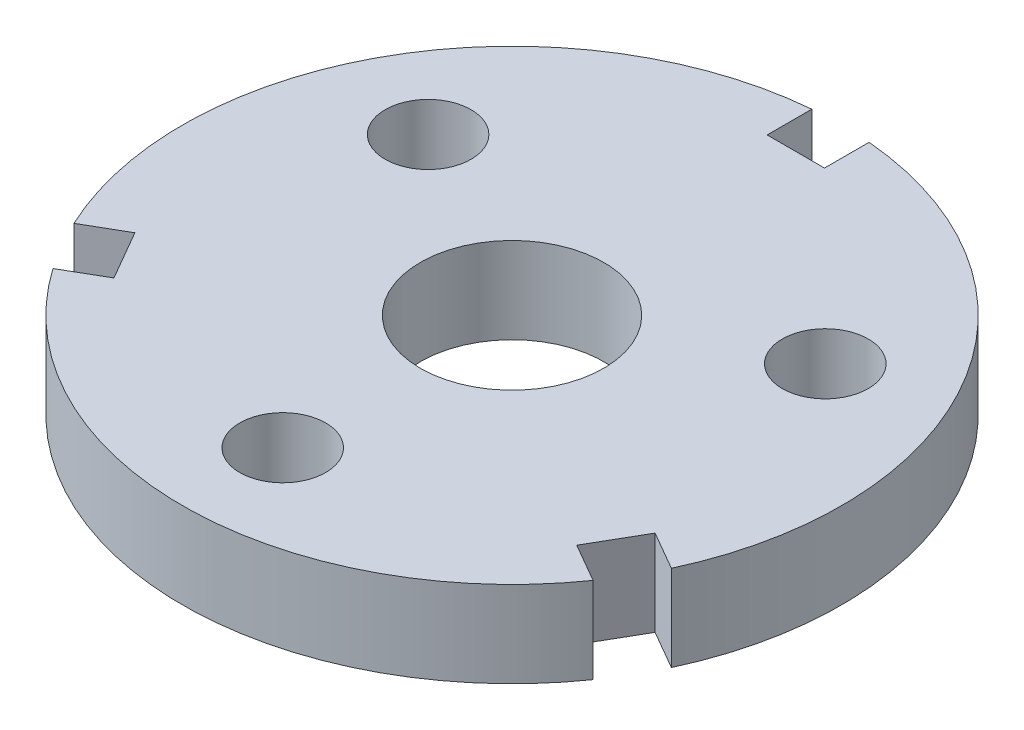
ISO-10303-21;
HEADER;
FILE_DESCRIPTION(('STEP AP214'),'2;1');
FILE_NAME('part.step','',(''),(''),'','','');
FILE_SCHEMA(('AUTOMOTIVE_DESIGN { 1 0 10303 214 1 1 1 1 }'));
ENDSEC;
DATA;
#1=APPLICATION_CONTEXT('core data for automotive mechanical design processes');
#2=APPLICATION_PROTOCOL_DEFINITION('international standard','automotive_design',2000,#1);
#3=PRODUCT_CONTEXT('',#1,'mechanical');
#4=PRODUCT('Part','Part','',(#3));
#5=PRODUCT_RELATED_PRODUCT_CATEGORY('part','',(#4));
#6=PRODUCT_DEFINITION_FORMATION('','',#4);
#7=PRODUCT_DEFINITION_CONTEXT('part definition',#1,'design');
#8=PRODUCT_DEFINITION('design','',#6,#7);
#9=PRODUCT_DEFINITION_SHAPE('','',#8);
#10=(LENGTH_UNIT() NAMED_UNIT(*) SI_UNIT(.MILLI.,.METRE.));
#11=(NAMED_UNIT(*) PLANE_ANGLE_UNIT() SI_UNIT($,.RADIAN.));
#12=(NAMED_UNIT(*) SI_UNIT($,.STERADIAN.) SOLID_ANGLE_UNIT());
#13=UNCERTAINTY_MEASURE_WITH_UNIT(LENGTH_MEASURE(1.E-05),#10,'distance_accuracy_value','');
#14=(GEOMETRIC_REPRESENTATION_CONTEXT(3) GLOBAL_UNCERTAINTY_ASSIGNED_CONTEXT((#13)) GLOBAL_UNIT_ASSIGNED_CONTEXT((#10,
#11,#12)) REPRESENTATION_CONTEXT('',''));
#15=CARTESIAN_POINT('',(0.,0.,0.));
#16=DIRECTION('',(0.,0.,1.));
#17=DIRECTION('',(1.,0.,0.));
#18=AXIS2_PLACEMENT_3D('',#15,#16,#17);
#19=CARTESIAN_POINT('',(0.,7.5,0.));
#20=DIRECTION('',(0.,1.,0.));
#21=DIRECTION('',(0.,0.,1.));
#22=AXIS2_PLACEMENT_3D('',#19,#20,#21);
#23=PLANE('',#22);
#24=CARTESIAN_POINT('',(-34.6410161513775,7.5,-20.0000000000002));
#25=DIRECTION('',(0.,1.,0.));
#26=DIRECTION('',(0.,0.,1.));
#27=AXIS2_PLACEMENT_3D('',#24,#25,#26);
#28=CIRCLE('',#27,7.5);
#29=CARTESIAN_POINT('',(-34.6410161513775,7.5,-12.5000000000002));
#30=VERTEX_POINT('',#29);
#31=EDGE_CURVE('E299',#30,#30,#28,.T.);
#32=ORIENTED_EDGE('',*,*,#31,.F.);
#33=EDGE_LOOP('',(#32));
#34=FACE_BOUND('',#33,.T.);
#35=CARTESIAN_POINT('',(0.,7.5,0.));
#36=DIRECTION('',(0.,1.,0.));
#37=DIRECTION('',(0.,0.,1.));
#38=AXIS2_PLACEMENT_3D('',#35,#36,#37);
#39=CIRCLE('',#38,16.);
#40=CARTESIAN_POINT('',(0.,7.5,16.));
#41=VERTEX_POINT('',#40);
#42=EDGE_CURVE('E166',#41,#41,#39,.T.);
#43=ORIENTED_EDGE('',*,*,#42,.F.);
#44=EDGE_LOOP('',(#43));
#45=FACE_BOUND('',#44,.T.);
#46=DIRECTION('',(0.,0.,1.));
#47=VECTOR('',#46,1.);
#48=CARTESIAN_POINT('',(5.00000000000001,7.5,-57.282196186948));
#49=LINE('',#48,#47);
#50=CARTESIAN_POINT('',(5.00000000000002,7.5,-57.282196186948));
#51=VERTEX_POINT('',#50);
#52=CARTESIAN_POINT('',(5.00000000000001,7.5,-49.5));
#53=VERTEX_POINT('',#52);
#54=EDGE_CURVE('E185',#51,#53,#49,.T.);
#55=ORIENTED_EDGE('',*,*,#54,.T.);
#56=DIRECTION('',(-1.,0.,0.));
#57=VECTOR('',#56,1.);
#58=CARTESIAN_POINT('',(-5.,7.5,-49.5));
#59=LINE('',#58,#57);
#60=CARTESIAN_POINT('',(-5.,7.5,-49.5));
#61=VERTEX_POINT('',#60);
#62=EDGE_CURVE('E113',#53,#61,#59,.T.);
#63=ORIENTED_EDGE('',*,*,#62,.T.);
#64=DIRECTION('',(0.,0.,-1.));
#65=VECTOR('',#64,1.);
#66=CARTESIAN_POINT('',(-5.,7.5,-57.282196186948));
#67=LINE('',#66,#65);
#68=CARTESIAN_POINT('',(-5.,7.5,-57.282196186948));
#69=VERTEX_POINT('',#68);
#70=EDGE_CURVE('E212',#61,#69,#67,.T.);
#71=ORIENTED_EDGE('',*,*,#70,.T.);
#72=CARTESIAN_POINT('',(0.,7.5,0.));
#73=DIRECTION('',(0.,1.,0.));
#74=DIRECTION('',(0.,0.,1.));
#75=AXIS2_PLACEMENT_3D('',#72,#73,#74);
#76=CIRCLE('',#75,57.5);
#77=CARTESIAN_POINT('',(-52.1078370824613,7.5,24.3109710745513));
#78=VERTEX_POINT('',#77);
#79=EDGE_CURVE('E231',#69,#78,#76,.T.);
#80=ORIENTED_EDGE('',*,*,#79,.T.);
#81=DIRECTION('',(0.866025403784443,0.,-0.499999999999992));
#82=VECTOR('',#81,1.);
#83=CARTESIAN_POINT('',(-52.1078370824613,7.5,24.3109710745513));
#84=LINE('',#83,#82);
#85=CARTESIAN_POINT('',(-45.3682574873299,7.5,20.4198729810774));
#86=VERTEX_POINT('',#85);
#87=EDGE_CURVE('E228',#78,#86,#84,.T.);
#88=ORIENTED_EDGE('',*,*,#87,.T.);
#89=DIRECTION('',(0.499999999999992,0.,0.866025403784443));
#90=VECTOR('',#89,1.);
#91=CARTESIAN_POINT('',(-40.36825748733,7.5,29.0801270189218));
#92=LINE('',#91,#90);
#93=CARTESIAN_POINT('',(-40.36825748733,7.5,29.0801270189218));
#94=VERTEX_POINT('',#93);
#95=EDGE_CURVE('E230',#86,#94,#92,.T.);
#96=ORIENTED_EDGE('',*,*,#95,.T.);
#97=DIRECTION('',(-0.866025403784443,0.,0.499999999999992));
#98=VECTOR('',#97,1.);
#99=CARTESIAN_POINT('',(-47.1078370824614,7.5,32.9712251123958));
#100=LINE('',#99,#98);
#101=CARTESIAN_POINT('',(-47.1078370824614,7.5,32.9712251123958));
#102=VERTEX_POINT('',#101);
#103=EDGE_CURVE('E233',#94,#102,#100,.T.);
#104=ORIENTED_EDGE('',*,*,#103,.T.);
#105=CARTESIAN_POINT('',(0.,7.5,0.));
#106=DIRECTION('',(0.,1.,0.));
#107=DIRECTION('',(0.,0.,1.));
#108=AXIS2_PLACEMENT_3D('',#105,#106,#107);
#109=CIRCLE('',#108,57.5);
#110=CARTESIAN_POINT('',(47.1078370824609,7.5,32.9712251123964));
#111=VERTEX_POINT('',#110);
#112=EDGE_CURVE('E239',#102,#111,#109,.T.);
#113=ORIENTED_EDGE('',*,*,#112,.T.);
#114=DIRECTION('',(-0.866025403784436,0.,-0.500000000000004));
#115=VECTOR('',#114,1.);
#116=CARTESIAN_POINT('',(47.1078370824609,7.5,32.9712251123964));
#117=LINE('',#116,#115);
#118=CARTESIAN_POINT('',(40.3682574873296,7.5,29.0801270189224));
#119=VERTEX_POINT('',#118);
#120=EDGE_CURVE('E144',#111,#119,#117,.T.);
#121=ORIENTED_EDGE('',*,*,#120,.T.);
#122=DIRECTION('',(0.500000000000004,0.,-0.866025403784436));
#123=VECTOR('',#122,1.);
#124=CARTESIAN_POINT('',(45.3682574873296,7.5,20.419872981078));
#125=LINE('',#124,#123);
#126=CARTESIAN_POINT('',(45.3682574873296,7.5,20.419872981078));
#127=VERTEX_POINT('',#126);
#128=EDGE_CURVE('E138',#119,#127,#125,.T.);
#129=ORIENTED_EDGE('',*,*,#128,.T.);
#130=DIRECTION('',(0.866025403784436,0.,0.500000000000004));
#131=VECTOR('',#130,1.);
#132=CARTESIAN_POINT('',(52.107837082461,7.5,24.3109710745521));
#133=LINE('',#132,#131);
#134=CARTESIAN_POINT('',(52.107837082461,7.5,24.3109710745521));
#135=VERTEX_POINT('',#134);
#136=EDGE_CURVE('E142',#127,#135,#133,.T.);
#137=ORIENTED_EDGE('',*,*,#136,.T.);
#138=CARTESIAN_POINT('',(0.,7.5,0.));
#139=DIRECTION('',(0.,1.,0.));
#140=DIRECTION('',(0.,0.,1.));
#141=AXIS2_PLACEMENT_3D('',#138,#139,#140);
#142=CIRCLE('',#141,57.5);
#143=EDGE_CURVE('E58',#135,#51,#142,.T.);
#144=ORIENTED_EDGE('',*,*,#143,.T.);
#145=EDGE_LOOP('',(#55,#63,#71,#80,#88,#96,#104,#113,#121,#129,#137,#144));
#146=FACE_BOUND('',#145,.T.);
#147=CARTESIAN_POINT('',(0.,7.5,40.));
#148=DIRECTION('',(0.,1.,0.));
#149=DIRECTION('',(0.,0.,1.));
#150=AXIS2_PLACEMENT_3D('',#147,#148,#149);
#151=CIRCLE('',#150,7.5);
#152=CARTESIAN_POINT('',(0.,7.5,47.5));
#153=VERTEX_POINT('',#152);
#154=EDGE_CURVE('E305',#153,#153,#151,.T.);
#155=ORIENTED_EDGE('',*,*,#154,.F.);
#156=EDGE_LOOP('',(#155));
#157=FACE_BOUND('',#156,.T.);
#158=CARTESIAN_POINT('',(34.6410161513775,7.5,-20.));
#159=DIRECTION('',(0.,1.,0.));
#160=DIRECTION('',(0.,0.,1.));
#161=AXIS2_PLACEMENT_3D('',#158,#159,#160);
#162=CIRCLE('',#161,7.49999999999963);
#163=CARTESIAN_POINT('',(34.6410161513775,7.5,-12.5000000000004));
#164=VERTEX_POINT('',#163);
#165=EDGE_CURVE('E290',#164,#164,#162,.T.);
#166=ORIENTED_EDGE('',*,*,#165,.F.);
#167=EDGE_LOOP('',(#166));
#168=FACE_BOUND('',#167,.T.);
#169=ADVANCED_FACE('F41',(#34,#45,#146,#157,#168),#23,.T.);
#170=CARTESIAN_POINT('',(0.,-7.5,0.));
#171=DIRECTION('',(0.,1.,0.));
#172=DIRECTION('',(0.,0.,1.));
#173=AXIS2_PLACEMENT_3D('',#170,#171,#172);
#174=PLANE('',#173);
#175=DIRECTION('',(0.,0.,1.));
#176=VECTOR('',#175,1.);
#177=CARTESIAN_POINT('',(5.00000000000001,-7.5,-57.282196186948));
#178=LINE('',#177,#176);
#179=CARTESIAN_POINT('',(5.00000000000002,-7.5,-57.282196186948));
#180=VERTEX_POINT('',#179);
#181=CARTESIAN_POINT('',(5.00000000000001,-7.5,-49.5));
#182=VERTEX_POINT('',#181);
#183=EDGE_CURVE('E162',#180,#182,#178,.T.);
#184=ORIENTED_EDGE('',*,*,#183,.F.);
#185=CARTESIAN_POINT('',(0.,-7.5,0.));
#186=DIRECTION('',(0.,1.,0.));
#187=DIRECTION('',(0.,0.,1.));
#188=AXIS2_PLACEMENT_3D('',#185,#186,#187);
#189=CIRCLE('',#188,57.5);
#190=CARTESIAN_POINT('',(52.107837082461,-7.5,24.3109710745521));
#191=VERTEX_POINT('',#190);
#192=EDGE_CURVE('E105',#191,#180,#189,.T.);
#193=ORIENTED_EDGE('',*,*,#192,.F.);
#194=DIRECTION('',(0.866025403784436,0.,0.500000000000004));
#195=VECTOR('',#194,1.);
#196=CARTESIAN_POINT('',(52.107837082461,-7.5,24.3109710745521));
#197=LINE('',#196,#195);
#198=CARTESIAN_POINT('',(45.3682574873296,-7.5,20.419872981078));
#199=VERTEX_POINT('',#198);
#200=EDGE_CURVE('E99',#199,#191,#197,.T.);
#201=ORIENTED_EDGE('',*,*,#200,.F.);
#202=DIRECTION('',(0.500000000000004,0.,-0.866025403784436));
#203=VECTOR('',#202,1.);
#204=CARTESIAN_POINT('',(45.3682574873296,-7.5,20.419872981078));
#205=LINE('',#204,#203);
#206=CARTESIAN_POINT('',(40.3682574873296,-7.5,29.0801270189224));
#207=VERTEX_POINT('',#206);
#208=EDGE_CURVE('E152',#207,#199,#205,.T.);
#209=ORIENTED_EDGE('',*,*,#208,.F.);
#210=DIRECTION('',(-0.866025403784436,0.,-0.500000000000004));
#211=VECTOR('',#210,1.);
#212=CARTESIAN_POINT('',(47.1078370824609,-7.5,32.9712251123964));
#213=LINE('',#212,#211);
#214=CARTESIAN_POINT('',(47.1078370824609,-7.5,32.9712251123964));
#215=VERTEX_POINT('',#214);
#216=EDGE_CURVE('E180',#215,#207,#213,.T.);
#217=ORIENTED_EDGE('',*,*,#216,.F.);
#218=CARTESIAN_POINT('',(0.,-7.5,0.));
#219=DIRECTION('',(0.,1.,0.));
#220=DIRECTION('',(0.,0.,1.));
#221=AXIS2_PLACEMENT_3D('',#218,#219,#220);
#222=CIRCLE('',#221,57.5);
#223=CARTESIAN_POINT('',(-47.1078370824614,-7.5,32.9712251123958));
#224=VERTEX_POINT('',#223);
#225=EDGE_CURVE('E178',#224,#215,#222,.T.);
#226=ORIENTED_EDGE('',*,*,#225,.F.);
#227=DIRECTION('',(-0.866025403784443,0.,0.499999999999992));
#228=VECTOR('',#227,1.);
#229=CARTESIAN_POINT('',(-47.1078370824614,-7.5,32.9712251123958));
#230=LINE('',#229,#228);
#231=CARTESIAN_POINT('',(-40.36825748733,-7.5,29.0801270189218));
#232=VERTEX_POINT('',#231);
#233=EDGE_CURVE('E176',#232,#224,#230,.T.);
#234=ORIENTED_EDGE('',*,*,#233,.F.);
#235=DIRECTION('',(0.499999999999992,0.,0.866025403784443));
#236=VECTOR('',#235,1.);
#237=CARTESIAN_POINT('',(-40.36825748733,-7.5,29.0801270189218));
#238=LINE('',#237,#236);
#239=CARTESIAN_POINT('',(-45.3682574873299,-7.5,20.4198729810774));
#240=VERTEX_POINT('',#239);
#241=EDGE_CURVE('E174',#240,#232,#238,.T.);
#242=ORIENTED_EDGE('',*,*,#241,.F.);
#243=DIRECTION('',(0.866025403784443,0.,-0.499999999999992));
#244=VECTOR('',#243,1.);
#245=CARTESIAN_POINT('',(-52.1078370824613,-7.5,24.3109710745513));
#246=LINE('',#245,#244);
#247=CARTESIAN_POINT('',(-52.1078370824613,-7.5,24.3109710745513));
#248=VERTEX_POINT('',#247);
#249=EDGE_CURVE('E172',#248,#240,#246,.T.);
#250=ORIENTED_EDGE('',*,*,#249,.F.);
#251=CARTESIAN_POINT('',(0.,-7.5,0.));
#252=DIRECTION('',(0.,1.,0.));
#253=DIRECTION('',(0.,0.,1.));
#254=AXIS2_PLACEMENT_3D('',#251,#252,#253);
#255=CIRCLE('',#254,57.5);
#256=CARTESIAN_POINT('',(-5.,-7.5,-57.282196186948));
#257=VERTEX_POINT('',#256);
#258=EDGE_CURVE('E170',#257,#248,#255,.T.);
#259=ORIENTED_EDGE('',*,*,#258,.F.);
#260=DIRECTION('',(0.,0.,-1.));
#261=VECTOR('',#260,1.);
#262=CARTESIAN_POINT('',(-5.,-7.5,-57.282196186948));
#263=LINE('',#262,#261);
#264=CARTESIAN_POINT('',(-5.,-7.5,-49.5));
#265=VERTEX_POINT('',#264);
#266=EDGE_CURVE('E168',#265,#257,#263,.T.);
#267=ORIENTED_EDGE('',*,*,#266,.F.);
#268=DIRECTION('',(-1.,0.,0.));
#269=VECTOR('',#268,1.);
#270=CARTESIAN_POINT('',(-5.,-7.5,-49.5));
#271=LINE('',#270,#269);
#272=EDGE_CURVE('E165',#182,#265,#271,.T.);
#273=ORIENTED_EDGE('',*,*,#272,.F.);
#274=EDGE_LOOP('',(#184,#193,#201,#209,#217,#226,#234,#242,#250,#259,#267,#273));
#275=FACE_BOUND('',#274,.T.);
#276=CARTESIAN_POINT('',(0.,-7.5,0.));
#277=DIRECTION('',(0.,1.,0.));
#278=DIRECTION('',(0.,0.,1.));
#279=AXIS2_PLACEMENT_3D('',#276,#277,#278);
#280=CIRCLE('',#279,16.);
#281=CARTESIAN_POINT('',(0.,-7.5,16.));
#282=VERTEX_POINT('',#281);
#283=EDGE_CURVE('E308',#282,#282,#280,.T.);
#284=ORIENTED_EDGE('',*,*,#283,.T.);
#285=EDGE_LOOP('',(#284));
#286=FACE_BOUND('',#285,.T.);
#287=CARTESIAN_POINT('',(0.,-7.5,40.));
#288=DIRECTION('',(0.,1.,0.));
#289=DIRECTION('',(0.,0.,1.));
#290=AXIS2_PLACEMENT_3D('',#287,#288,#289);
#291=CIRCLE('',#290,7.5);
#292=CARTESIAN_POINT('',(0.,-7.5,47.5));
#293=VERTEX_POINT('',#292);
#294=EDGE_CURVE('E302',#293,#293,#291,.T.);
#295=ORIENTED_EDGE('',*,*,#294,.T.);
#296=EDGE_LOOP('',(#295));
#297=FACE_BOUND('',#296,.T.);
#298=CARTESIAN_POINT('',(-34.6410161513775,-7.5,-20.0000000000002));
#299=DIRECTION('',(0.,1.,0.));
#300=DIRECTION('',(0.,0.,1.));
#301=AXIS2_PLACEMENT_3D('',#298,#299,#300);
#302=CIRCLE('',#301,7.5);
#303=CARTESIAN_POINT('',(-34.6410161513775,-7.5,-12.5000000000002));
#304=VERTEX_POINT('',#303);
#305=EDGE_CURVE('E296',#304,#304,#302,.T.);
#306=ORIENTED_EDGE('',*,*,#305,.T.);
#307=EDGE_LOOP('',(#306));
#308=FACE_BOUND('',#307,.T.);
#309=CARTESIAN_POINT('',(34.6410161513775,-7.5,-20.));
#310=DIRECTION('',(0.,1.,0.));
#311=DIRECTION('',(0.,0.,1.));
#312=AXIS2_PLACEMENT_3D('',#309,#310,#311);
#313=CIRCLE('',#312,7.49999999999963);
#314=CARTESIAN_POINT('',(34.6410161513775,-7.5,-12.5000000000004));
#315=VERTEX_POINT('',#314);
#316=EDGE_CURVE('E293',#315,#315,#313,.T.);
#317=ORIENTED_EDGE('',*,*,#316,.T.);
#318=EDGE_LOOP('',(#317));
#319=FACE_BOUND('',#318,.T.);
#320=ADVANCED_FACE('F216',(#275,#286,#297,#308,#319),#174,.F.);
#321=CARTESIAN_POINT('',(5.00000000000001,7.5,-57.282196186948));
#322=DIRECTION('',(1.,0.,0.));
#323=DIRECTION('',(0.,0.,-1.));
#324=AXIS2_PLACEMENT_3D('',#321,#322,#323);
#325=PLANE('',#324);
#326=ORIENTED_EDGE('',*,*,#183,.T.);
#327=DIRECTION('',(0.,-1.,0.));
#328=VECTOR('',#327,1.);
#329=CARTESIAN_POINT('',(5.00000000000001,7.5,-49.5));
#330=LINE('',#329,#328);
#331=EDGE_CURVE('E11',#53,#182,#330,.T.);
#332=ORIENTED_EDGE('',*,*,#331,.F.);
#333=ORIENTED_EDGE('',*,*,#54,.F.);
#334=DIRECTION('',(0.,-1.,0.));
#335=VECTOR('',#334,1.);
#336=CARTESIAN_POINT('',(5.00000000000002,7.5,-57.282196186948));
#337=LINE('',#336,#335);
#338=EDGE_CURVE('E158',#51,#180,#337,.T.);
#339=ORIENTED_EDGE('',*,*,#338,.T.);
#340=EDGE_LOOP('',(#326,#332,#333,#339));
#341=FACE_BOUND('',#340,.T.);
#342=ADVANCED_FACE('F43',(#341),#325,.F.);
#343=CARTESIAN_POINT('',(-5.,7.5,-49.5));
#344=DIRECTION('',(0.,0.,1.));
#345=DIRECTION('',(1.,0.,0.));
#346=AXIS2_PLACEMENT_3D('',#343,#344,#345);
#347=PLANE('',#346);
#348=ORIENTED_EDGE('',*,*,#272,.T.);
#349=DIRECTION('',(0.,-1.,0.));
#350=VECTOR('',#349,1.);
#351=CARTESIAN_POINT('',(-5.,7.5,-49.5));
#352=LINE('',#351,#350);
#353=EDGE_CURVE('E50',#61,#265,#352,.T.);
#354=ORIENTED_EDGE('',*,*,#353,.F.);
#355=ORIENTED_EDGE('',*,*,#62,.F.);
#356=ORIENTED_EDGE('',*,*,#331,.T.);
#357=EDGE_LOOP('',(#348,#354,#355,#356));
#358=FACE_BOUND('',#357,.T.);
#359=ADVANCED_FACE('F428',(#358),#347,.F.);
#360=CARTESIAN_POINT('',(-5.,7.5,-57.282196186948));
#361=DIRECTION('',(-1.,0.,0.));
#362=DIRECTION('',(0.,0.,1.));
#363=AXIS2_PLACEMENT_3D('',#360,#361,#362);
#364=PLANE('',#363);
#365=ORIENTED_EDGE('',*,*,#266,.T.);
#366=DIRECTION('',(0.,-1.,0.));
#367=VECTOR('',#366,1.);
#368=CARTESIAN_POINT('',(-5.,7.5,-57.282196186948));
#369=LINE('',#368,#367);
#370=EDGE_CURVE('E204',#69,#257,#369,.T.);
#371=ORIENTED_EDGE('',*,*,#370,.F.);
#372=ORIENTED_EDGE('',*,*,#70,.F.);
#373=ORIENTED_EDGE('',*,*,#353,.T.);
#374=EDGE_LOOP('',(#365,#371,#372,#373));
#375=FACE_BOUND('',#374,.T.);
#376=ADVANCED_FACE('F210',(#375),#364,.F.);
#377=CARTESIAN_POINT('',(0.,7.5,0.));
#378=DIRECTION('',(0.,-1.,0.));
#379=DIRECTION('',(0.,0.,-1.));
#380=AXIS2_PLACEMENT_3D('',#377,#378,#379);
#381=CYLINDRICAL_SURFACE('',#380,57.5);
#382=ORIENTED_EDGE('',*,*,#258,.T.);
#383=DIRECTION('',(0.,-1.,0.));
#384=VECTOR('',#383,1.);
#385=CARTESIAN_POINT('',(-52.1078370824613,7.5,24.3109710745513));
#386=LINE('',#385,#384);
#387=EDGE_CURVE('E201',#78,#248,#386,.T.);
#388=ORIENTED_EDGE('',*,*,#387,.F.);
#389=ORIENTED_EDGE('',*,*,#79,.F.);
#390=ORIENTED_EDGE('',*,*,#370,.T.);
#391=EDGE_LOOP('',(#382,#388,#389,#390));
#392=FACE_BOUND('',#391,.T.);
#393=ADVANCED_FACE('F222',(#392),#381,.T.);
#394=CARTESIAN_POINT('',(-52.1078370824613,7.5,24.3109710745513));
#395=DIRECTION('',(-0.499999999999992,0.,-0.866025403784443));
#396=DIRECTION('',(-0.866025403784443,0.,0.499999999999992));
#397=AXIS2_PLACEMENT_3D('',#394,#395,#396);
#398=PLANE('',#397);
#399=ORIENTED_EDGE('',*,*,#249,.T.);
#400=DIRECTION('',(0.,-1.,0.));
#401=VECTOR('',#400,1.);
#402=CARTESIAN_POINT('',(-45.3682574873299,7.5,20.4198729810774));
#403=LINE('',#402,#401);
#404=EDGE_CURVE('E198',#86,#240,#403,.T.);
#405=ORIENTED_EDGE('',*,*,#404,.F.);
#406=ORIENTED_EDGE('',*,*,#87,.F.);
#407=ORIENTED_EDGE('',*,*,#387,.T.);
#408=EDGE_LOOP('',(#399,#405,#406,#407));
#409=FACE_BOUND('',#408,.T.);
#410=ADVANCED_FACE('F226',(#409),#398,.F.);
#411=CARTESIAN_POINT('',(-40.36825748733,7.5,29.0801270189218));
#412=DIRECTION('',(0.866025403784443,0.,-0.499999999999992));
#413=DIRECTION('',(-0.499999999999992,0.,-0.866025403784443));
#414=AXIS2_PLACEMENT_3D('',#411,#412,#413);
#415=PLANE('',#414);
#416=ORIENTED_EDGE('',*,*,#241,.T.);
#417=DIRECTION('',(0.,-1.,0.));
#418=VECTOR('',#417,1.);
#419=CARTESIAN_POINT('',(-40.36825748733,7.5,29.0801270189218));
#420=LINE('',#419,#418);
#421=EDGE_CURVE('E195',#94,#232,#420,.T.);
#422=ORIENTED_EDGE('',*,*,#421,.F.);
#423=ORIENTED_EDGE('',*,*,#95,.F.);
#424=ORIENTED_EDGE('',*,*,#404,.T.);
#425=EDGE_LOOP('',(#416,#422,#423,#424));
#426=FACE_BOUND('',#425,.T.);
#427=ADVANCED_FACE('F389',(#426),#415,.F.);
#428=CARTESIAN_POINT('',(-47.1078370824614,7.5,32.9712251123958));
#429=DIRECTION('',(0.499999999999992,0.,0.866025403784443));
#430=DIRECTION('',(0.866025403784443,0.,-0.499999999999992));
#431=AXIS2_PLACEMENT_3D('',#428,#429,#430);
#432=PLANE('',#431);
#433=ORIENTED_EDGE('',*,*,#233,.T.);
#434=DIRECTION('',(0.,-1.,0.));
#435=VECTOR('',#434,1.);
#436=CARTESIAN_POINT('',(-47.1078370824614,7.5,32.9712251123958));
#437=LINE('',#436,#435);
#438=EDGE_CURVE('E192',#102,#224,#437,.T.);
#439=ORIENTED_EDGE('',*,*,#438,.F.);
#440=ORIENTED_EDGE('',*,*,#103,.F.);
#441=ORIENTED_EDGE('',*,*,#421,.T.);
#442=EDGE_LOOP('',(#433,#439,#440,#441));
#443=FACE_BOUND('',#442,.T.);
#444=ADVANCED_FACE('F379',(#443),#432,.F.);
#445=CARTESIAN_POINT('',(0.,7.5,0.));
#446=DIRECTION('',(0.,-1.,0.));
#447=DIRECTION('',(0.,0.,-1.));
#448=AXIS2_PLACEMENT_3D('',#445,#446,#447);
#449=CYLINDRICAL_SURFACE('',#448,57.5);
#450=ORIENTED_EDGE('',*,*,#225,.T.);
#451=DIRECTION('',(0.,-1.,0.));
#452=VECTOR('',#451,1.);
#453=CARTESIAN_POINT('',(47.1078370824609,7.5,32.9712251123964));
#454=LINE('',#453,#452);
#455=EDGE_CURVE('E189',#111,#215,#454,.T.);
#456=ORIENTED_EDGE('',*,*,#455,.F.);
#457=ORIENTED_EDGE('',*,*,#112,.F.);
#458=ORIENTED_EDGE('',*,*,#438,.T.);
#459=EDGE_LOOP('',(#450,#456,#457,#458));
#460=FACE_BOUND('',#459,.T.);
#461=ADVANCED_FACE('F245',(#460),#449,.T.);
#462=CARTESIAN_POINT('',(47.1078370824609,7.5,32.9712251123964));
#463=DIRECTION('',(-0.500000000000004,0.,0.866025403784436));
#464=DIRECTION('',(0.866025403784436,0.,0.500000000000004));
#465=AXIS2_PLACEMENT_3D('',#462,#463,#464);
#466=PLANE('',#465);
#467=ORIENTED_EDGE('',*,*,#216,.T.);
#468=DIRECTION('',(0.,-1.,0.));
#469=VECTOR('',#468,1.);
#470=CARTESIAN_POINT('',(40.3682574873296,7.5,29.0801270189224));
#471=LINE('',#470,#469);
#472=EDGE_CURVE('E153',#119,#207,#471,.T.);
#473=ORIENTED_EDGE('',*,*,#472,.F.);
#474=ORIENTED_EDGE('',*,*,#120,.F.);
#475=ORIENTED_EDGE('',*,*,#455,.T.);
#476=EDGE_LOOP('',(#467,#473,#474,#475));
#477=FACE_BOUND('',#476,.T.);
#478=ADVANCED_FACE('F249',(#477),#466,.F.);
#479=CARTESIAN_POINT('',(45.3682574873296,7.5,20.419872981078));
#480=DIRECTION('',(-0.866025403784436,0.,-0.500000000000004));
#481=DIRECTION('',(-0.500000000000004,0.,0.866025403784436));
#482=AXIS2_PLACEMENT_3D('',#479,#480,#481);
#483=PLANE('',#482);
#484=ORIENTED_EDGE('',*,*,#208,.T.);
#485=DIRECTION('',(0.,-1.,0.));
#486=VECTOR('',#485,1.);
#487=CARTESIAN_POINT('',(45.3682574873296,7.5,20.419872981078));
#488=LINE('',#487,#486);
#489=EDGE_CURVE('E149',#127,#199,#488,.T.);
#490=ORIENTED_EDGE('',*,*,#489,.F.);
#491=ORIENTED_EDGE('',*,*,#128,.F.);
#492=ORIENTED_EDGE('',*,*,#472,.T.);
#493=EDGE_LOOP('',(#484,#490,#491,#492));
#494=FACE_BOUND('',#493,.T.);
#495=ADVANCED_FACE('F150',(#494),#483,.F.);
#496=CARTESIAN_POINT('',(52.107837082461,7.5,24.3109710745521));
#497=DIRECTION('',(0.500000000000004,0.,-0.866025403784436));
#498=DIRECTION('',(-0.866025403784436,0.,-0.500000000000004));
#499=AXIS2_PLACEMENT_3D('',#496,#497,#498);
#500=PLANE('',#499);
#501=ORIENTED_EDGE('',*,*,#200,.T.);
#502=DIRECTION('',(0.,-1.,0.));
#503=VECTOR('',#502,1.);
#504=CARTESIAN_POINT('',(52.107837082461,7.5,24.3109710745521));
#505=LINE('',#504,#503);
#506=EDGE_CURVE('E154',#135,#191,#505,.T.);
#507=ORIENTED_EDGE('',*,*,#506,.F.);
#508=ORIENTED_EDGE('',*,*,#136,.F.);
#509=ORIENTED_EDGE('',*,*,#489,.T.);
#510=EDGE_LOOP('',(#501,#507,#508,#509));
#511=FACE_BOUND('',#510,.T.);
#512=ADVANCED_FACE('F156',(#511),#500,.F.);
#513=CARTESIAN_POINT('',(0.,7.5,0.));
#514=DIRECTION('',(0.,-1.,0.));
#515=DIRECTION('',(0.,0.,-1.));
#516=AXIS2_PLACEMENT_3D('',#513,#514,#515);
#517=CYLINDRICAL_SURFACE('',#516,57.5);
#518=ORIENTED_EDGE('',*,*,#192,.T.);
#519=ORIENTED_EDGE('',*,*,#338,.F.);
#520=ORIENTED_EDGE('',*,*,#143,.F.);
#521=ORIENTED_EDGE('',*,*,#506,.T.);
#522=EDGE_LOOP('',(#518,#519,#520,#521));
#523=FACE_BOUND('',#522,.T.);
#524=ADVANCED_FACE('F253',(#523),#517,.T.);
#525=CARTESIAN_POINT('',(0.,7.5,0.));
#526=DIRECTION('',(0.,-1.,0.));
#527=DIRECTION('',(0.,0.,-1.));
#528=AXIS2_PLACEMENT_3D('',#525,#526,#527);
#529=CYLINDRICAL_SURFACE('',#528,16.);
#530=ORIENTED_EDGE('',*,*,#42,.T.);
#531=EDGE_LOOP('',(#530));
#532=FACE_BOUND('',#531,.T.);
#533=ORIENTED_EDGE('',*,*,#283,.F.);
#534=EDGE_LOOP('',(#533));
#535=FACE_BOUND('',#534,.T.);
#536=ADVANCED_FACE('F255',(#532,#535),#529,.F.);
#537=CARTESIAN_POINT('',(0.,7.5,40.));
#538=DIRECTION('',(0.,-1.,0.));
#539=DIRECTION('',(0.,0.,-1.));
#540=AXIS2_PLACEMENT_3D('',#537,#538,#539);
#541=CYLINDRICAL_SURFACE('',#540,7.5);
#542=ORIENTED_EDGE('',*,*,#154,.T.);
#543=EDGE_LOOP('',(#542));
#544=FACE_BOUND('',#543,.T.);
#545=ORIENTED_EDGE('',*,*,#294,.F.);
#546=EDGE_LOOP('',(#545));
#547=FACE_BOUND('',#546,.T.);
#548=ADVANCED_FACE('F261',(#544,#547),#541,.F.);
#549=CARTESIAN_POINT('',(-34.6410161513775,7.5,-20.0000000000002));
#550=DIRECTION('',(0.,-1.,0.));
#551=DIRECTION('',(0.,0.,-1.));
#552=AXIS2_PLACEMENT_3D('',#549,#550,#551);
#553=CYLINDRICAL_SURFACE('',#552,7.5);
#554=ORIENTED_EDGE('',*,*,#31,.T.);
#555=EDGE_LOOP('',(#554));
#556=FACE_BOUND('',#555,.T.);
#557=ORIENTED_EDGE('',*,*,#305,.F.);
#558=EDGE_LOOP('',(#557));
#559=FACE_BOUND('',#558,.T.);
#560=ADVANCED_FACE('F277',(#556,#559),#553,.F.);
#561=CARTESIAN_POINT('',(34.6410161513775,7.5,-20.));
#562=DIRECTION('',(0.,-1.,0.));
#563=DIRECTION('',(0.,0.,-1.));
#564=AXIS2_PLACEMENT_3D('',#561,#562,#563);
#565=CYLINDRICAL_SURFACE('',#564,7.49999999999963);
#566=ORIENTED_EDGE('',*,*,#165,.T.);
#567=EDGE_LOOP('',(#566));
#568=FACE_BOUND('',#567,.T.);
#569=ORIENTED_EDGE('',*,*,#316,.F.);
#570=EDGE_LOOP('',(#569));
#571=FACE_BOUND('',#570,.T.);
#572=ADVANCED_FACE('F281',(#568,#571),#565,.F.);
#573=CLOSED_SHELL('',(#169,#320,#342,#359,#376,#393,#410,#427,#444,#461,#478,#495,#512,#524,
#536,#548,#560,#572));
#574=MANIFOLD_SOLID_BREP('B2',#573);
#575=ADVANCED_BREP_SHAPE_REPRESENTATION('',(#18,#574),#14);
#576=SHAPE_DEFINITION_REPRESENTATION(#9,#575);
ENDSEC;
END-ISO-10303-21;
